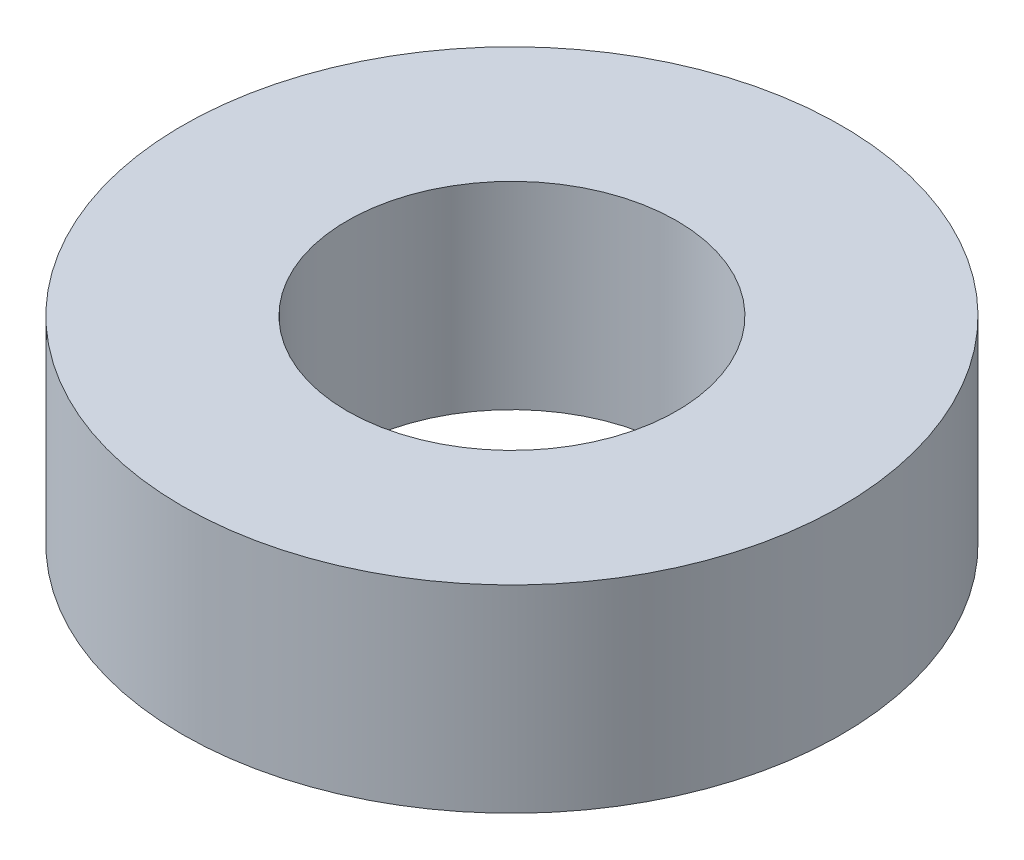
ISO-10303-21;
HEADER;
FILE_DESCRIPTION(('STEP AP214'),'2;1');
FILE_NAME('part.step','',(''),(''),'','','');
FILE_SCHEMA(('AUTOMOTIVE_DESIGN { 1 0 10303 214 1 1 1 1 }'));
ENDSEC;
DATA;
#1=APPLICATION_CONTEXT('core data for automotive mechanical design processes');
#2=APPLICATION_PROTOCOL_DEFINITION('international standard','automotive_design',2000,#1);
#3=PRODUCT_CONTEXT('',#1,'mechanical');
#4=PRODUCT('Part','Part','',(#3));
#5=PRODUCT_RELATED_PRODUCT_CATEGORY('part','',(#4));
#6=PRODUCT_DEFINITION_FORMATION('','',#4);
#7=PRODUCT_DEFINITION_CONTEXT('part definition',#1,'design');
#8=PRODUCT_DEFINITION('design','',#6,#7);
#9=PRODUCT_DEFINITION_SHAPE('','',#8);
#10=(LENGTH_UNIT() NAMED_UNIT(*) SI_UNIT(.MILLI.,.METRE.));
#11=(NAMED_UNIT(*) PLANE_ANGLE_UNIT() SI_UNIT($,.RADIAN.));
#12=(NAMED_UNIT(*) SI_UNIT($,.STERADIAN.) SOLID_ANGLE_UNIT());
#13=UNCERTAINTY_MEASURE_WITH_UNIT(LENGTH_MEASURE(1.E-05),#10,'distance_accuracy_value','');
#14=(GEOMETRIC_REPRESENTATION_CONTEXT(3) GLOBAL_UNCERTAINTY_ASSIGNED_CONTEXT((#13)) GLOBAL_UNIT_ASSIGNED_CONTEXT((#10,
#11,#12)) REPRESENTATION_CONTEXT('',''));
#15=CARTESIAN_POINT('',(0.,0.,0.));
#16=DIRECTION('',(0.,0.,1.));
#17=DIRECTION('',(1.,0.,0.));
#18=AXIS2_PLACEMENT_3D('',#15,#16,#17);
#19=CARTESIAN_POINT('',(0.,7.62,0.));
#20=DIRECTION('',(0.,1.,0.));
#21=DIRECTION('',(0.,0.,1.));
#22=AXIS2_PLACEMENT_3D('',#19,#20,#21);
#23=PLANE('',#22);
#24=CARTESIAN_POINT('',(0.,7.62,0.));
#25=DIRECTION('',(0.,1.,0.));
#26=DIRECTION('',(0.,0.,1.));
#27=AXIS2_PLACEMENT_3D('',#24,#25,#26);
#28=CIRCLE('',#27,12.7);
#29=CARTESIAN_POINT('',(0.,7.62,12.7));
#30=VERTEX_POINT('',#29);
#31=EDGE_CURVE('E10',#30,#30,#28,.T.);
#32=ORIENTED_EDGE('',*,*,#31,.T.);
#33=EDGE_LOOP('',(#32));
#34=FACE_BOUND('',#33,.T.);
#35=CARTESIAN_POINT('',(0.,7.62,0.));
#36=DIRECTION('',(0.,1.,0.));
#37=DIRECTION('',(0.,0.,1.));
#38=AXIS2_PLACEMENT_3D('',#35,#36,#37);
#39=CIRCLE('',#38,6.35);
#40=CARTESIAN_POINT('',(0.,7.62,6.35));
#41=VERTEX_POINT('',#40);
#42=EDGE_CURVE('E50',#41,#41,#39,.T.);
#43=ORIENTED_EDGE('',*,*,#42,.F.);
#44=EDGE_LOOP('',(#43));
#45=FACE_BOUND('',#44,.T.);
#46=ADVANCED_FACE('F37',(#34,#45),#23,.T.);
#47=CARTESIAN_POINT('',(0.,0.,0.));
#48=DIRECTION('',(0.,1.,0.));
#49=DIRECTION('',(0.,0.,1.));
#50=AXIS2_PLACEMENT_3D('',#47,#48,#49);
#51=PLANE('',#50);
#52=CARTESIAN_POINT('',(0.,0.,0.));
#53=DIRECTION('',(0.,1.,0.));
#54=DIRECTION('',(0.,0.,1.));
#55=AXIS2_PLACEMENT_3D('',#52,#53,#54);
#56=CIRCLE('',#55,12.7);
#57=CARTESIAN_POINT('',(0.,0.,12.7));
#58=VERTEX_POINT('',#57);
#59=EDGE_CURVE('E41',#58,#58,#56,.T.);
#60=ORIENTED_EDGE('',*,*,#59,.F.);
#61=EDGE_LOOP('',(#60));
#62=FACE_BOUND('',#61,.T.);
#63=CARTESIAN_POINT('',(0.,0.,0.));
#64=DIRECTION('',(0.,1.,0.));
#65=DIRECTION('',(0.,0.,1.));
#66=AXIS2_PLACEMENT_3D('',#63,#64,#65);
#67=CIRCLE('',#66,6.35);
#68=CARTESIAN_POINT('',(0.,0.,6.35));
#69=VERTEX_POINT('',#68);
#70=EDGE_CURVE('E52',#69,#69,#67,.T.);
#71=ORIENTED_EDGE('',*,*,#70,.T.);
#72=EDGE_LOOP('',(#71));
#73=FACE_BOUND('',#72,.T.);
#74=ADVANCED_FACE('F64',(#62,#73),#51,.F.);
#75=CARTESIAN_POINT('',(0.,7.62,0.));
#76=DIRECTION('',(0.,-1.,0.));
#77=DIRECTION('',(0.,0.,-1.));
#78=AXIS2_PLACEMENT_3D('',#75,#76,#77);
#79=CYLINDRICAL_SURFACE('',#78,12.7);
#80=ORIENTED_EDGE('',*,*,#31,.F.);
#81=EDGE_LOOP('',(#80));
#82=FACE_BOUND('',#81,.T.);
#83=ORIENTED_EDGE('',*,*,#59,.T.);
#84=EDGE_LOOP('',(#83));
#85=FACE_BOUND('',#84,.T.);
#86=ADVANCED_FACE('F39',(#82,#85),#79,.T.);
#87=CARTESIAN_POINT('',(0.,7.62,0.));
#88=DIRECTION('',(0.,-1.,0.));
#89=DIRECTION('',(0.,0.,-1.));
#90=AXIS2_PLACEMENT_3D('',#87,#88,#89);
#91=CYLINDRICAL_SURFACE('',#90,6.35);
#92=ORIENTED_EDGE('',*,*,#42,.T.);
#93=EDGE_LOOP('',(#92));
#94=FACE_BOUND('',#93,.T.);
#95=ORIENTED_EDGE('',*,*,#70,.F.);
#96=EDGE_LOOP('',(#95));
#97=FACE_BOUND('',#96,.T.);
#98=ADVANCED_FACE('F60',(#94,#97),#91,.F.);
#99=CLOSED_SHELL('',(#46,#74,#86,#98));
#100=MANIFOLD_SOLID_BREP('B2',#99);
#101=ADVANCED_BREP_SHAPE_REPRESENTATION('',(#18,#100),#14);
#102=SHAPE_DEFINITION_REPRESENTATION(#9,#101);
ENDSEC;
END-ISO-10303-21;
